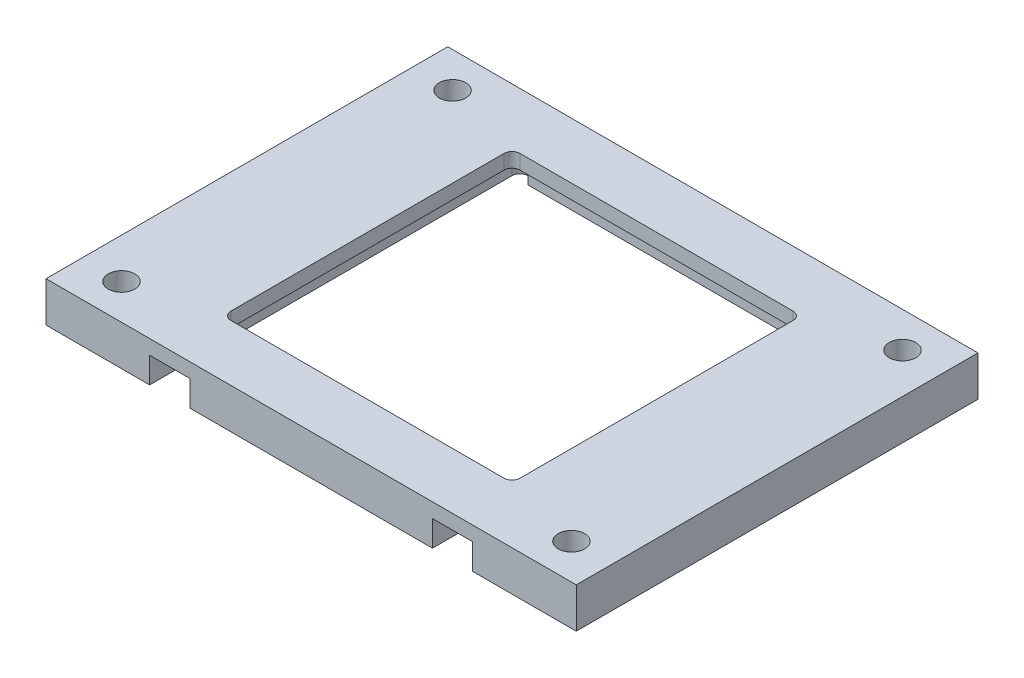
ISO-10303-21;
HEADER;
FILE_DESCRIPTION(('STEP AP214'),'2;1');
FILE_NAME('part.step','',(''),(''),'','','');
FILE_SCHEMA(('AUTOMOTIVE_DESIGN { 1 0 10303 214 1 1 1 1 }'));
ENDSEC;
DATA;
#1=APPLICATION_CONTEXT('core data for automotive mechanical design processes');
#2=APPLICATION_PROTOCOL_DEFINITION('international standard','automotive_design',2000,#1);
#3=PRODUCT_CONTEXT('',#1,'mechanical');
#4=PRODUCT('Part','Part','',(#3));
#5=PRODUCT_RELATED_PRODUCT_CATEGORY('part','',(#4));
#6=PRODUCT_DEFINITION_FORMATION('','',#4);
#7=PRODUCT_DEFINITION_CONTEXT('part definition',#1,'design');
#8=PRODUCT_DEFINITION('design','',#6,#7);
#9=PRODUCT_DEFINITION_SHAPE('','',#8);
#10=(LENGTH_UNIT() NAMED_UNIT(*) SI_UNIT(.MILLI.,.METRE.));
#11=(NAMED_UNIT(*) PLANE_ANGLE_UNIT() SI_UNIT($,.RADIAN.));
#12=(NAMED_UNIT(*) SI_UNIT($,.STERADIAN.) SOLID_ANGLE_UNIT());
#13=UNCERTAINTY_MEASURE_WITH_UNIT(LENGTH_MEASURE(1.E-05),#10,'distance_accuracy_value','');
#14=(GEOMETRIC_REPRESENTATION_CONTEXT(3) GLOBAL_UNCERTAINTY_ASSIGNED_CONTEXT((#13)) GLOBAL_UNIT_ASSIGNED_CONTEXT((#10,
#11,#12)) REPRESENTATION_CONTEXT('',''));
#15=CARTESIAN_POINT('',(0.,0.,0.));
#16=DIRECTION('',(0.,0.,1.));
#17=DIRECTION('',(1.,0.,0.));
#18=AXIS2_PLACEMENT_3D('',#15,#16,#17);
#19=CARTESIAN_POINT('',(0.,0.,0.));
#20=DIRECTION('',(0.,-1.,0.));
#21=DIRECTION('',(0.,0.,-1.));
#22=AXIS2_PLACEMENT_3D('',#19,#20,#21);
#23=PLANE('',#22);
#24=CARTESIAN_POINT('',(-19.1,0.,-20.1));
#25=DIRECTION('',(0.,-1.,0.));
#26=DIRECTION('',(0.,0.,-1.));
#27=AXIS2_PLACEMENT_3D('',#24,#25,#26);
#28=CIRCLE('',#27,1.);
#29=CARTESIAN_POINT('',(-18.1,0.,-20.1));
#30=VERTEX_POINT('',#29);
#31=CARTESIAN_POINT('',(-19.1,0.,-21.1));
#32=VERTEX_POINT('',#31);
#33=EDGE_CURVE('E58',#30,#32,#28,.F.);
#34=ORIENTED_EDGE('',*,*,#33,.T.);
#35=CARTESIAN_POINT('',(-19.1,0.,-20.1));
#36=DIRECTION('',(0.,-1.,0.));
#37=DIRECTION('',(0.,0.,-1.));
#38=AXIS2_PLACEMENT_3D('',#35,#36,#37);
#39=CIRCLE('',#38,1.);
#40=CARTESIAN_POINT('',(-20.1,0.,-20.1));
#41=VERTEX_POINT('',#40);
#42=EDGE_CURVE('E312',#32,#41,#39,.F.);
#43=ORIENTED_EDGE('',*,*,#42,.T.);
#44=DIRECTION('',(0.,0.,1.));
#45=VECTOR('',#44,1.);
#46=CARTESIAN_POINT('',(-20.1,0.,-21.1));
#47=LINE('',#46,#45);
#48=CARTESIAN_POINT('',(-20.1,0.,25.));
#49=VERTEX_POINT('',#48);
#50=EDGE_CURVE('E229',#41,#49,#47,.T.);
#51=ORIENTED_EDGE('',*,*,#50,.T.);
#52=DIRECTION('',(1.,0.,0.));
#53=VECTOR('',#52,1.);
#54=CARTESIAN_POINT('',(-33.,0.,25.));
#55=LINE('',#54,#53);
#56=CARTESIAN_POINT('',(-33.,0.,25.));
#57=VERTEX_POINT('',#56);
#58=EDGE_CURVE('E249',#57,#49,#55,.T.);
#59=ORIENTED_EDGE('',*,*,#58,.F.);
#60=DIRECTION('',(0.,0.,1.));
#61=VECTOR('',#60,1.);
#62=CARTESIAN_POINT('',(-33.,0.,25.));
#63=LINE('',#62,#61);
#64=CARTESIAN_POINT('',(-33.,0.,-25.));
#65=VERTEX_POINT('',#64);
#66=EDGE_CURVE('E260',#65,#57,#63,.T.);
#67=ORIENTED_EDGE('',*,*,#66,.F.);
#68=DIRECTION('',(-1.,0.,0.));
#69=VECTOR('',#68,1.);
#70=CARTESIAN_POINT('',(-33.,0.,-25.));
#71=LINE('',#70,#69);
#72=CARTESIAN_POINT('',(33.,0.,-25.));
#73=VERTEX_POINT('',#72);
#74=EDGE_CURVE('E258',#73,#65,#71,.T.);
#75=ORIENTED_EDGE('',*,*,#74,.F.);
#76=DIRECTION('',(0.,0.,-1.));
#77=VECTOR('',#76,1.);
#78=CARTESIAN_POINT('',(33.,0.,25.));
#79=LINE('',#78,#77);
#80=CARTESIAN_POINT('',(33.,0.,25.));
#81=VERTEX_POINT('',#80);
#82=EDGE_CURVE('E244',#81,#73,#79,.T.);
#83=ORIENTED_EDGE('',*,*,#82,.F.);
#84=CARTESIAN_POINT('',(20.1,0.,25.));
#85=VERTEX_POINT('',#84);
#86=EDGE_CURVE('E262',#85,#81,#55,.T.);
#87=ORIENTED_EDGE('',*,*,#86,.F.);
#88=DIRECTION('',(0.,0.,-1.));
#89=VECTOR('',#88,1.);
#90=CARTESIAN_POINT('',(20.1,0.,20.1));
#91=LINE('',#90,#89);
#92=CARTESIAN_POINT('',(20.1,0.,-20.1));
#93=VERTEX_POINT('',#92);
#94=EDGE_CURVE('E228',#85,#93,#91,.T.);
#95=ORIENTED_EDGE('',*,*,#94,.T.);
#96=CARTESIAN_POINT('',(19.1,0.,-20.1));
#97=DIRECTION('',(0.,-1.,0.));
#98=DIRECTION('',(0.,0.,-1.));
#99=AXIS2_PLACEMENT_3D('',#96,#97,#98);
#100=CIRCLE('',#99,1.);
#101=CARTESIAN_POINT('',(19.1,0.,-21.1));
#102=VERTEX_POINT('',#101);
#103=EDGE_CURVE('E65',#93,#102,#100,.F.);
#104=ORIENTED_EDGE('',*,*,#103,.T.);
#105=CARTESIAN_POINT('',(19.1,0.,-20.1));
#106=DIRECTION('',(0.,-1.,0.));
#107=DIRECTION('',(0.,0.,-1.));
#108=AXIS2_PLACEMENT_3D('',#105,#106,#107);
#109=CIRCLE('',#108,1.);
#110=CARTESIAN_POINT('',(18.1,0.,-20.1));
#111=VERTEX_POINT('',#110);
#112=EDGE_CURVE('E308',#102,#111,#109,.F.);
#113=ORIENTED_EDGE('',*,*,#112,.T.);
#114=DIRECTION('',(-1.,0.,0.));
#115=VECTOR('',#114,1.);
#116=CARTESIAN_POINT('',(-18.1,0.,-20.1));
#117=LINE('',#116,#115);
#118=EDGE_CURVE('E231',#111,#30,#117,.T.);
#119=ORIENTED_EDGE('',*,*,#118,.T.);
#120=EDGE_LOOP('',(#34,#43,#51,#59,#67,#75,#83,#87,#95,#104,#113,#119));
#121=FACE_BOUND('',#120,.T.);
#122=CARTESIAN_POINT('',(-28.,0.,20.6));
#123=DIRECTION('',(0.,1.,0.));
#124=DIRECTION('',(0.,0.,1.));
#125=AXIS2_PLACEMENT_3D('',#122,#123,#124);
#126=CIRCLE('',#125,1.65);
#127=CARTESIAN_POINT('',(-28.,0.,22.25));
#128=VERTEX_POINT('',#127);
#129=EDGE_CURVE('E429',#128,#128,#126,.T.);
#130=ORIENTED_EDGE('',*,*,#129,.T.);
#131=EDGE_LOOP('',(#130));
#132=FACE_BOUND('',#131,.T.);
#133=CARTESIAN_POINT('',(-28.,0.,-20.6));
#134=DIRECTION('',(0.,1.,0.));
#135=DIRECTION('',(0.,0.,1.));
#136=AXIS2_PLACEMENT_3D('',#133,#134,#135);
#137=CIRCLE('',#136,1.65);
#138=CARTESIAN_POINT('',(-28.,0.,-18.95));
#139=VERTEX_POINT('',#138);
#140=EDGE_CURVE('E441',#139,#139,#137,.T.);
#141=ORIENTED_EDGE('',*,*,#140,.T.);
#142=EDGE_LOOP('',(#141));
#143=FACE_BOUND('',#142,.T.);
#144=CARTESIAN_POINT('',(28.,0.,-20.6));
#145=DIRECTION('',(0.,1.,0.));
#146=DIRECTION('',(0.,0.,1.));
#147=AXIS2_PLACEMENT_3D('',#144,#145,#146);
#148=CIRCLE('',#147,1.65);
#149=CARTESIAN_POINT('',(28.,0.,-18.95));
#150=VERTEX_POINT('',#149);
#151=EDGE_CURVE('E435',#150,#150,#148,.T.);
#152=ORIENTED_EDGE('',*,*,#151,.T.);
#153=EDGE_LOOP('',(#152));
#154=FACE_BOUND('',#153,.T.);
#155=CARTESIAN_POINT('',(28.,0.,20.6));
#156=DIRECTION('',(0.,1.,0.));
#157=DIRECTION('',(0.,0.,1.));
#158=AXIS2_PLACEMENT_3D('',#155,#156,#157);
#159=CIRCLE('',#158,1.65);
#160=CARTESIAN_POINT('',(28.,0.,22.25));
#161=VERTEX_POINT('',#160);
#162=EDGE_CURVE('E425',#161,#161,#159,.T.);
#163=ORIENTED_EDGE('',*,*,#162,.T.);
#164=EDGE_LOOP('',(#163));
#165=FACE_BOUND('',#164,.T.);
#166=ADVANCED_FACE('F41',(#121,#132,#143,#154,#165),#23,.T.);
#167=CARTESIAN_POINT('',(-20.1,5.,-21.1));
#168=DIRECTION('',(1.,0.,0.));
#169=DIRECTION('',(0.,0.,-1.));
#170=AXIS2_PLACEMENT_3D('',#167,#168,#169);
#171=PLANE('',#170);
#172=ORIENTED_EDGE('',*,*,#50,.F.);
#173=DIRECTION('',(0.,-1.,0.));
#174=VECTOR('',#173,1.);
#175=CARTESIAN_POINT('',(-20.1,3.2,-20.1));
#176=LINE('',#175,#174);
#177=CARTESIAN_POINT('',(-20.1,3.2,-20.1));
#178=VERTEX_POINT('',#177);
#179=EDGE_CURVE('E286',#41,#178,#176,.F.);
#180=ORIENTED_EDGE('',*,*,#179,.T.);
#181=DIRECTION('',(0.,0.,1.));
#182=VECTOR('',#181,1.);
#183=CARTESIAN_POINT('',(-20.1,3.2,-21.1));
#184=LINE('',#183,#182);
#185=CARTESIAN_POINT('',(-20.1,3.2,25.));
#186=VERTEX_POINT('',#185);
#187=EDGE_CURVE('E351',#178,#186,#184,.T.);
#188=ORIENTED_EDGE('',*,*,#187,.T.);
#189=DIRECTION('',(0.,-1.,0.));
#190=VECTOR('',#189,1.);
#191=CARTESIAN_POINT('',(-20.1,0.,25.));
#192=LINE('',#191,#190);
#193=EDGE_CURVE('E223',#186,#49,#192,.T.);
#194=ORIENTED_EDGE('',*,*,#193,.T.);
#195=EDGE_LOOP('',(#172,#180,#188,#194));
#196=FACE_BOUND('',#195,.T.);
#197=ADVANCED_FACE('F348',(#196),#171,.T.);
#198=CARTESIAN_POINT('',(-20.1,5.,20.1));
#199=DIRECTION('',(0.,0.,-1.));
#200=DIRECTION('',(-1.,0.,0.));
#201=AXIS2_PLACEMENT_3D('',#198,#199,#200);
#202=PLANE('',#201);
#203=DIRECTION('',(0.,1.,0.));
#204=VECTOR('',#203,1.);
#205=CARTESIAN_POINT('',(-15.1,0.,20.1));
#206=LINE('',#205,#204);
#207=CARTESIAN_POINT('',(-15.1,0.,20.1));
#208=VERTEX_POINT('',#207);
#209=CARTESIAN_POINT('',(-15.1,3.2,20.1));
#210=VERTEX_POINT('',#209);
#211=EDGE_CURVE('E202',#208,#210,#206,.T.);
#212=ORIENTED_EDGE('',*,*,#211,.T.);
#213=DIRECTION('',(1.,0.,0.));
#214=VECTOR('',#213,1.);
#215=CARTESIAN_POINT('',(-20.1,3.2,20.1));
#216=LINE('',#215,#214);
#217=CARTESIAN_POINT('',(15.1,3.2,20.1));
#218=VERTEX_POINT('',#217);
#219=EDGE_CURVE('E417',#210,#218,#216,.T.);
#220=ORIENTED_EDGE('',*,*,#219,.T.);
#221=DIRECTION('',(0.,-1.,0.));
#222=VECTOR('',#221,1.);
#223=CARTESIAN_POINT('',(15.1,0.,20.1));
#224=LINE('',#223,#222);
#225=CARTESIAN_POINT('',(15.1,0.,20.1));
#226=VERTEX_POINT('',#225);
#227=EDGE_CURVE('E213',#218,#226,#224,.T.);
#228=ORIENTED_EDGE('',*,*,#227,.T.);
#229=DIRECTION('',(1.,0.,0.));
#230=VECTOR('',#229,1.);
#231=CARTESIAN_POINT('',(-20.1,0.,20.1));
#232=LINE('',#231,#230);
#233=EDGE_CURVE('E220',#208,#226,#232,.T.);
#234=ORIENTED_EDGE('',*,*,#233,.F.);
#235=EDGE_LOOP('',(#212,#220,#228,#234));
#236=FACE_BOUND('',#235,.T.);
#237=ADVANCED_FACE('F226',(#236),#202,.T.);
#238=CARTESIAN_POINT('',(20.1,5.,20.1));
#239=DIRECTION('',(-1.,0.,0.));
#240=DIRECTION('',(0.,0.,1.));
#241=AXIS2_PLACEMENT_3D('',#238,#239,#240);
#242=PLANE('',#241);
#243=DIRECTION('',(0.,0.,-1.));
#244=VECTOR('',#243,1.);
#245=CARTESIAN_POINT('',(20.1,3.2,20.1));
#246=LINE('',#245,#244);
#247=CARTESIAN_POINT('',(20.1,3.2,25.));
#248=VERTEX_POINT('',#247);
#249=CARTESIAN_POINT('',(20.1,3.2,-20.1));
#250=VERTEX_POINT('',#249);
#251=EDGE_CURVE('E419',#248,#250,#246,.T.);
#252=ORIENTED_EDGE('',*,*,#251,.T.);
#253=DIRECTION('',(0.,-1.,0.));
#254=VECTOR('',#253,1.);
#255=CARTESIAN_POINT('',(20.1,0.,-20.1));
#256=LINE('',#255,#254);
#257=EDGE_CURVE('E284',#250,#93,#256,.T.);
#258=ORIENTED_EDGE('',*,*,#257,.T.);
#259=ORIENTED_EDGE('',*,*,#94,.F.);
#260=DIRECTION('',(0.,1.,0.));
#261=VECTOR('',#260,1.);
#262=CARTESIAN_POINT('',(20.1,0.,25.));
#263=LINE('',#262,#261);
#264=EDGE_CURVE('E386',#85,#248,#263,.T.);
#265=ORIENTED_EDGE('',*,*,#264,.T.);
#266=EDGE_LOOP('',(#252,#258,#259,#265));
#267=FACE_BOUND('',#266,.T.);
#268=ADVANCED_FACE('F487',(#267),#242,.T.);
#269=CARTESIAN_POINT('',(-18.1,5.,-20.1));
#270=DIRECTION('',(0.,0.,1.));
#271=DIRECTION('',(1.,0.,0.));
#272=AXIS2_PLACEMENT_3D('',#269,#270,#271);
#273=PLANE('',#272);
#274=DIRECTION('',(0.,-1.,0.));
#275=VECTOR('',#274,1.);
#276=CARTESIAN_POINT('',(18.1,5.,-20.1));
#277=LINE('',#276,#275);
#278=CARTESIAN_POINT('',(18.1,3.2,-20.1));
#279=VERTEX_POINT('',#278);
#280=EDGE_CURVE('E241',#279,#111,#277,.T.);
#281=ORIENTED_EDGE('',*,*,#280,.F.);
#282=DIRECTION('',(-1.,0.,0.));
#283=VECTOR('',#282,1.);
#284=CARTESIAN_POINT('',(18.1,3.2,-20.1));
#285=LINE('',#284,#283);
#286=CARTESIAN_POINT('',(-18.1,3.2,-20.1));
#287=VERTEX_POINT('',#286);
#288=EDGE_CURVE('E422',#279,#287,#285,.T.);
#289=ORIENTED_EDGE('',*,*,#288,.T.);
#290=DIRECTION('',(0.,-1.,0.));
#291=VECTOR('',#290,1.);
#292=CARTESIAN_POINT('',(-18.1,5.,-20.1));
#293=LINE('',#292,#291);
#294=EDGE_CURVE('E238',#287,#30,#293,.T.);
#295=ORIENTED_EDGE('',*,*,#294,.T.);
#296=ORIENTED_EDGE('',*,*,#118,.F.);
#297=EDGE_LOOP('',(#281,#289,#295,#296));
#298=FACE_BOUND('',#297,.T.);
#299=ADVANCED_FACE('F481',(#298),#273,.T.);
#300=CARTESIAN_POINT('',(0.,5.,0.));
#301=DIRECTION('',(0.,-1.,0.));
#302=DIRECTION('',(0.,0.,-1.));
#303=AXIS2_PLACEMENT_3D('',#300,#301,#302);
#304=PLANE('',#303);
#305=DIRECTION('',(0.,0.,-1.));
#306=VECTOR('',#305,1.);
#307=CARTESIAN_POINT('',(33.,5.,25.));
#308=LINE('',#307,#306);
#309=CARTESIAN_POINT('',(33.,5.,25.));
#310=VERTEX_POINT('',#309);
#311=CARTESIAN_POINT('',(33.,5.,-25.));
#312=VERTEX_POINT('',#311);
#313=EDGE_CURVE('E245',#310,#312,#308,.T.);
#314=ORIENTED_EDGE('',*,*,#313,.T.);
#315=DIRECTION('',(-1.,0.,0.));
#316=VECTOR('',#315,1.);
#317=CARTESIAN_POINT('',(-33.,5.,-25.));
#318=LINE('',#317,#316);
#319=CARTESIAN_POINT('',(-33.,5.,-25.));
#320=VERTEX_POINT('',#319);
#321=EDGE_CURVE('E248',#312,#320,#318,.T.);
#322=ORIENTED_EDGE('',*,*,#321,.T.);
#323=DIRECTION('',(0.,0.,1.));
#324=VECTOR('',#323,1.);
#325=CARTESIAN_POINT('',(-33.,5.,25.));
#326=LINE('',#325,#324);
#327=CARTESIAN_POINT('',(-33.,5.,25.));
#328=VERTEX_POINT('',#327);
#329=EDGE_CURVE('E251',#320,#328,#326,.T.);
#330=ORIENTED_EDGE('',*,*,#329,.T.);
#331=DIRECTION('',(1.,0.,0.));
#332=VECTOR('',#331,1.);
#333=CARTESIAN_POINT('',(-33.,5.,25.));
#334=LINE('',#333,#332);
#335=EDGE_CURVE('E253',#328,#310,#334,.T.);
#336=ORIENTED_EDGE('',*,*,#335,.T.);
#337=EDGE_LOOP('',(#314,#322,#330,#336));
#338=FACE_BOUND('',#337,.T.);
#339=CARTESIAN_POINT('',(-28.,5.,-20.6));
#340=DIRECTION('',(0.,1.,0.));
#341=DIRECTION('',(0.,0.,1.));
#342=AXIS2_PLACEMENT_3D('',#339,#340,#341);
#343=CIRCLE('',#342,1.65);
#344=CARTESIAN_POINT('',(-28.,5.,-18.95));
#345=VERTEX_POINT('',#344);
#346=EDGE_CURVE('E233',#345,#345,#343,.T.);
#347=ORIENTED_EDGE('',*,*,#346,.F.);
#348=EDGE_LOOP('',(#347));
#349=FACE_BOUND('',#348,.T.);
#350=CARTESIAN_POINT('',(28.,5.,-20.6));
#351=DIRECTION('',(0.,1.,0.));
#352=DIRECTION('',(0.,0.,1.));
#353=AXIS2_PLACEMENT_3D('',#350,#351,#352);
#354=CIRCLE('',#353,1.65);
#355=CARTESIAN_POINT('',(28.,5.,-18.95));
#356=VERTEX_POINT('',#355);
#357=EDGE_CURVE('E438',#356,#356,#354,.T.);
#358=ORIENTED_EDGE('',*,*,#357,.F.);
#359=EDGE_LOOP('',(#358));
#360=FACE_BOUND('',#359,.T.);
#361=CARTESIAN_POINT('',(-28.,5.,20.6));
#362=DIRECTION('',(0.,1.,0.));
#363=DIRECTION('',(0.,0.,1.));
#364=AXIS2_PLACEMENT_3D('',#361,#362,#363);
#365=CIRCLE('',#364,1.65);
#366=CARTESIAN_POINT('',(-28.,5.,22.25));
#367=VERTEX_POINT('',#366);
#368=EDGE_CURVE('E432',#367,#367,#365,.T.);
#369=ORIENTED_EDGE('',*,*,#368,.F.);
#370=EDGE_LOOP('',(#369));
#371=FACE_BOUND('',#370,.T.);
#372=CARTESIAN_POINT('',(28.,5.,20.6));
#373=DIRECTION('',(0.,1.,0.));
#374=DIRECTION('',(0.,0.,1.));
#375=AXIS2_PLACEMENT_3D('',#372,#373,#374);
#376=CIRCLE('',#375,1.65);
#377=CARTESIAN_POINT('',(28.,5.,22.25));
#378=VERTEX_POINT('',#377);
#379=EDGE_CURVE('E426',#378,#378,#376,.T.);
#380=ORIENTED_EDGE('',*,*,#379,.F.);
#381=EDGE_LOOP('',(#380));
#382=FACE_BOUND('',#381,.T.);
#383=DIRECTION('',(0.,0.,1.));
#384=VECTOR('',#383,1.);
#385=CARTESIAN_POINT('',(-18.,5.,-18.));
#386=LINE('',#385,#384);
#387=CARTESIAN_POINT('',(-18.,5.,-17.));
#388=VERTEX_POINT('',#387);
#389=CARTESIAN_POINT('',(-18.,5.,17.));
#390=VERTEX_POINT('',#389);
#391=EDGE_CURVE('E379',#388,#390,#386,.T.);
#392=ORIENTED_EDGE('',*,*,#391,.F.);
#393=CARTESIAN_POINT('',(-17.,5.,-17.));
#394=DIRECTION('',(0.,-1.,0.));
#395=DIRECTION('',(0.,0.,-1.));
#396=AXIS2_PLACEMENT_3D('',#393,#394,#395);
#397=CIRCLE('',#396,1.);
#398=CARTESIAN_POINT('',(-17.,5.,-18.));
#399=VERTEX_POINT('',#398);
#400=EDGE_CURVE('E50',#388,#399,#397,.T.);
#401=ORIENTED_EDGE('',*,*,#400,.T.);
#402=DIRECTION('',(-1.,0.,0.));
#403=VECTOR('',#402,1.);
#404=CARTESIAN_POINT('',(18.,5.,-18.));
#405=LINE('',#404,#403);
#406=CARTESIAN_POINT('',(17.,5.,-18.));
#407=VERTEX_POINT('',#406);
#408=EDGE_CURVE('E397',#407,#399,#405,.T.);
#409=ORIENTED_EDGE('',*,*,#408,.F.);
#410=CARTESIAN_POINT('',(17.,5.,-17.));
#411=DIRECTION('',(0.,-1.,0.));
#412=DIRECTION('',(0.,0.,-1.));
#413=AXIS2_PLACEMENT_3D('',#410,#411,#412);
#414=CIRCLE('',#413,1.);
#415=CARTESIAN_POINT('',(18.,5.,-17.));
#416=VERTEX_POINT('',#415);
#417=EDGE_CURVE('E322',#407,#416,#414,.T.);
#418=ORIENTED_EDGE('',*,*,#417,.T.);
#419=DIRECTION('',(0.,0.,-1.));
#420=VECTOR('',#419,1.);
#421=CARTESIAN_POINT('',(18.,5.,18.));
#422=LINE('',#421,#420);
#423=CARTESIAN_POINT('',(18.,5.,17.));
#424=VERTEX_POINT('',#423);
#425=EDGE_CURVE('E411',#424,#416,#422,.T.);
#426=ORIENTED_EDGE('',*,*,#425,.F.);
#427=CARTESIAN_POINT('',(17.,5.,17.));
#428=DIRECTION('',(0.,-1.,0.));
#429=DIRECTION('',(0.,0.,-1.));
#430=AXIS2_PLACEMENT_3D('',#427,#428,#429);
#431=CIRCLE('',#430,1.);
#432=CARTESIAN_POINT('',(17.,5.,18.));
#433=VERTEX_POINT('',#432);
#434=EDGE_CURVE('E318',#424,#433,#431,.T.);
#435=ORIENTED_EDGE('',*,*,#434,.T.);
#436=DIRECTION('',(1.,0.,0.));
#437=VECTOR('',#436,1.);
#438=CARTESIAN_POINT('',(-18.,5.,18.));
#439=LINE('',#438,#437);
#440=CARTESIAN_POINT('',(-17.,5.,18.));
#441=VERTEX_POINT('',#440);
#442=EDGE_CURVE('E408',#441,#433,#439,.T.);
#443=ORIENTED_EDGE('',*,*,#442,.F.);
#444=CARTESIAN_POINT('',(-17.,5.,17.));
#445=DIRECTION('',(0.,-1.,0.));
#446=DIRECTION('',(0.,0.,-1.));
#447=AXIS2_PLACEMENT_3D('',#444,#445,#446);
#448=CIRCLE('',#447,1.);
#449=EDGE_CURVE('E314',#441,#390,#448,.T.);
#450=ORIENTED_EDGE('',*,*,#449,.T.);
#451=EDGE_LOOP('',(#392,#401,#409,#418,#426,#435,#443,#450));
#452=FACE_BOUND('',#451,.T.);
#453=ADVANCED_FACE('F474',(#338,#349,#360,#371,#382,#452),#304,.F.);
#454=DIRECTION('',(0.,0.,1.));
#455=VECTOR('',#454,1.);
#456=CARTESIAN_POINT('',(-15.1,0.,-25.001));
#457=LINE('',#456,#455);
#458=CARTESIAN_POINT('',(-15.1,0.,25.));
#459=VERTEX_POINT('',#458);
#460=EDGE_CURVE('E206',#208,#459,#457,.T.);
#461=ORIENTED_EDGE('',*,*,#460,.F.);
#462=ORIENTED_EDGE('',*,*,#233,.T.);
#463=DIRECTION('',(0.,0.,1.));
#464=VECTOR('',#463,1.);
#465=CARTESIAN_POINT('',(15.1,0.,-25.001));
#466=LINE('',#465,#464);
#467=CARTESIAN_POINT('',(15.1,0.,25.));
#468=VERTEX_POINT('',#467);
#469=EDGE_CURVE('E385',#226,#468,#466,.T.);
#470=ORIENTED_EDGE('',*,*,#469,.T.);
#471=EDGE_CURVE('E222',#459,#468,#55,.T.);
#472=ORIENTED_EDGE('',*,*,#471,.F.);
#473=EDGE_LOOP('',(#461,#462,#470,#472));
#474=FACE_BOUND('',#473,.T.);
#475=ADVANCED_FACE('F218',(#474),#23,.T.);
#476=CARTESIAN_POINT('',(33.,5.,25.));
#477=DIRECTION('',(-1.,0.,0.));
#478=DIRECTION('',(0.,0.,1.));
#479=AXIS2_PLACEMENT_3D('',#476,#477,#478);
#480=PLANE('',#479);
#481=ORIENTED_EDGE('',*,*,#82,.T.);
#482=DIRECTION('',(0.,-1.,0.));
#483=VECTOR('',#482,1.);
#484=CARTESIAN_POINT('',(33.,5.,-25.));
#485=LINE('',#484,#483);
#486=EDGE_CURVE('E273',#312,#73,#485,.T.);
#487=ORIENTED_EDGE('',*,*,#486,.F.);
#488=ORIENTED_EDGE('',*,*,#313,.F.);
#489=DIRECTION('',(0.,-1.,0.));
#490=VECTOR('',#489,1.);
#491=CARTESIAN_POINT('',(33.,5.,25.));
#492=LINE('',#491,#490);
#493=EDGE_CURVE('E255',#310,#81,#492,.T.);
#494=ORIENTED_EDGE('',*,*,#493,.T.);
#495=EDGE_LOOP('',(#481,#487,#488,#494));
#496=FACE_BOUND('',#495,.T.);
#497=ADVANCED_FACE('F371',(#496),#480,.F.);
#498=CARTESIAN_POINT('',(-33.,5.,-25.));
#499=DIRECTION('',(0.,0.,1.));
#500=DIRECTION('',(1.,0.,0.));
#501=AXIS2_PLACEMENT_3D('',#498,#499,#500);
#502=PLANE('',#501);
#503=ORIENTED_EDGE('',*,*,#74,.T.);
#504=DIRECTION('',(0.,-1.,0.));
#505=VECTOR('',#504,1.);
#506=CARTESIAN_POINT('',(-33.,5.,-25.));
#507=LINE('',#506,#505);
#508=EDGE_CURVE('E270',#320,#65,#507,.T.);
#509=ORIENTED_EDGE('',*,*,#508,.F.);
#510=ORIENTED_EDGE('',*,*,#321,.F.);
#511=ORIENTED_EDGE('',*,*,#486,.T.);
#512=EDGE_LOOP('',(#503,#509,#510,#511));
#513=FACE_BOUND('',#512,.T.);
#514=ADVANCED_FACE('F367',(#513),#502,.F.);
#515=CARTESIAN_POINT('',(-33.,5.,25.));
#516=DIRECTION('',(1.,0.,0.));
#517=DIRECTION('',(0.,0.,-1.));
#518=AXIS2_PLACEMENT_3D('',#515,#516,#517);
#519=PLANE('',#518);
#520=ORIENTED_EDGE('',*,*,#66,.T.);
#521=DIRECTION('',(0.,-1.,0.));
#522=VECTOR('',#521,1.);
#523=CARTESIAN_POINT('',(-33.,5.,25.));
#524=LINE('',#523,#522);
#525=EDGE_CURVE('E267',#328,#57,#524,.T.);
#526=ORIENTED_EDGE('',*,*,#525,.F.);
#527=ORIENTED_EDGE('',*,*,#329,.F.);
#528=ORIENTED_EDGE('',*,*,#508,.T.);
#529=EDGE_LOOP('',(#520,#526,#527,#528));
#530=FACE_BOUND('',#529,.T.);
#531=ADVANCED_FACE('F363',(#530),#519,.F.);
#532=CARTESIAN_POINT('',(-33.,5.,25.));
#533=DIRECTION('',(0.,0.,-1.));
#534=DIRECTION('',(-1.,0.,0.));
#535=AXIS2_PLACEMENT_3D('',#532,#533,#534);
#536=PLANE('',#535);
#537=ORIENTED_EDGE('',*,*,#58,.T.);
#538=ORIENTED_EDGE('',*,*,#193,.F.);
#539=DIRECTION('',(-1.,0.,0.));
#540=VECTOR('',#539,1.);
#541=CARTESIAN_POINT('',(-20.1,3.2,25.));
#542=LINE('',#541,#540);
#543=CARTESIAN_POINT('',(-15.1,3.2,25.));
#544=VERTEX_POINT('',#543);
#545=EDGE_CURVE('E377',#544,#186,#542,.T.);
#546=ORIENTED_EDGE('',*,*,#545,.F.);
#547=DIRECTION('',(0.,1.,0.));
#548=VECTOR('',#547,1.);
#549=CARTESIAN_POINT('',(-15.1,0.,25.));
#550=LINE('',#549,#548);
#551=EDGE_CURVE('E355',#459,#544,#550,.T.);
#552=ORIENTED_EDGE('',*,*,#551,.F.);
#553=ORIENTED_EDGE('',*,*,#471,.T.);
#554=DIRECTION('',(0.,-1.,0.));
#555=VECTOR('',#554,1.);
#556=CARTESIAN_POINT('',(15.1,0.,25.));
#557=LINE('',#556,#555);
#558=CARTESIAN_POINT('',(15.1,3.2,25.));
#559=VERTEX_POINT('',#558);
#560=EDGE_CURVE('E328',#559,#468,#557,.T.);
#561=ORIENTED_EDGE('',*,*,#560,.F.);
#562=DIRECTION('',(-1.,0.,0.));
#563=VECTOR('',#562,1.);
#564=CARTESIAN_POINT('',(20.1,3.2,25.));
#565=LINE('',#564,#563);
#566=EDGE_CURVE('E331',#248,#559,#565,.T.);
#567=ORIENTED_EDGE('',*,*,#566,.F.);
#568=ORIENTED_EDGE('',*,*,#264,.F.);
#569=ORIENTED_EDGE('',*,*,#86,.T.);
#570=ORIENTED_EDGE('',*,*,#493,.F.);
#571=ORIENTED_EDGE('',*,*,#335,.F.);
#572=ORIENTED_EDGE('',*,*,#525,.T.);
#573=EDGE_LOOP('',(#537,#538,#546,#552,#553,#561,#567,#568,#569,#570,#571,#572));
#574=FACE_BOUND('',#573,.T.);
#575=ADVANCED_FACE('F357',(#574),#536,.F.);
#576=CARTESIAN_POINT('',(-28.,5.,-20.6));
#577=DIRECTION('',(0.,-1.,0.));
#578=DIRECTION('',(0.,0.,-1.));
#579=AXIS2_PLACEMENT_3D('',#576,#577,#578);
#580=CYLINDRICAL_SURFACE('',#579,1.65);
#581=ORIENTED_EDGE('',*,*,#346,.T.);
#582=EDGE_LOOP('',(#581));
#583=FACE_BOUND('',#582,.T.);
#584=ORIENTED_EDGE('',*,*,#140,.F.);
#585=EDGE_LOOP('',(#584));
#586=FACE_BOUND('',#585,.T.);
#587=ADVANCED_FACE('F450',(#583,#586),#580,.F.);
#588=CARTESIAN_POINT('',(28.,5.,-20.6));
#589=DIRECTION('',(0.,-1.,0.));
#590=DIRECTION('',(0.,0.,-1.));
#591=AXIS2_PLACEMENT_3D('',#588,#589,#590);
#592=CYLINDRICAL_SURFACE('',#591,1.65);
#593=ORIENTED_EDGE('',*,*,#357,.T.);
#594=EDGE_LOOP('',(#593));
#595=FACE_BOUND('',#594,.T.);
#596=ORIENTED_EDGE('',*,*,#151,.F.);
#597=EDGE_LOOP('',(#596));
#598=FACE_BOUND('',#597,.T.);
#599=ADVANCED_FACE('F452',(#595,#598),#592,.F.);
#600=CARTESIAN_POINT('',(-28.,5.,20.6));
#601=DIRECTION('',(0.,-1.,0.));
#602=DIRECTION('',(0.,0.,-1.));
#603=AXIS2_PLACEMENT_3D('',#600,#601,#602);
#604=CYLINDRICAL_SURFACE('',#603,1.65);
#605=ORIENTED_EDGE('',*,*,#368,.T.);
#606=EDGE_LOOP('',(#605));
#607=FACE_BOUND('',#606,.T.);
#608=ORIENTED_EDGE('',*,*,#129,.F.);
#609=EDGE_LOOP('',(#608));
#610=FACE_BOUND('',#609,.T.);
#611=ADVANCED_FACE('F459',(#607,#610),#604,.F.);
#612=CARTESIAN_POINT('',(28.,5.,20.6));
#613=DIRECTION('',(0.,-1.,0.));
#614=DIRECTION('',(0.,0.,-1.));
#615=AXIS2_PLACEMENT_3D('',#612,#613,#614);
#616=CYLINDRICAL_SURFACE('',#615,1.65);
#617=ORIENTED_EDGE('',*,*,#379,.T.);
#618=EDGE_LOOP('',(#617));
#619=FACE_BOUND('',#618,.T.);
#620=ORIENTED_EDGE('',*,*,#162,.F.);
#621=EDGE_LOOP('',(#620));
#622=FACE_BOUND('',#621,.T.);
#623=ADVANCED_FACE('F531',(#619,#622),#616,.F.);
#624=CARTESIAN_POINT('',(0.,3.2,0.));
#625=DIRECTION('',(0.,1.,0.));
#626=DIRECTION('',(0.,0.,1.));
#627=AXIS2_PLACEMENT_3D('',#624,#625,#626);
#628=PLANE('',#627);
#629=DIRECTION('',(0.,0.,-1.));
#630=VECTOR('',#629,1.);
#631=CARTESIAN_POINT('',(18.,3.2,18.));
#632=LINE('',#631,#630);
#633=CARTESIAN_POINT('',(18.,3.2,17.));
#634=VERTEX_POINT('',#633);
#635=CARTESIAN_POINT('',(18.,3.2,-17.));
#636=VERTEX_POINT('',#635);
#637=EDGE_CURVE('E400',#634,#636,#632,.T.);
#638=ORIENTED_EDGE('',*,*,#637,.T.);
#639=CARTESIAN_POINT('',(17.,3.2,-17.));
#640=DIRECTION('',(0.,1.,0.));
#641=DIRECTION('',(0.,0.,1.));
#642=AXIS2_PLACEMENT_3D('',#639,#640,#641);
#643=CIRCLE('',#642,1.);
#644=CARTESIAN_POINT('',(17.,3.2,-18.));
#645=VERTEX_POINT('',#644);
#646=EDGE_CURVE('E324',#636,#645,#643,.T.);
#647=ORIENTED_EDGE('',*,*,#646,.T.);
#648=DIRECTION('',(-1.,0.,0.));
#649=VECTOR('',#648,1.);
#650=CARTESIAN_POINT('',(18.,3.2,-18.));
#651=LINE('',#650,#649);
#652=CARTESIAN_POINT('',(-17.,3.2,-18.));
#653=VERTEX_POINT('',#652);
#654=EDGE_CURVE('E403',#645,#653,#651,.T.);
#655=ORIENTED_EDGE('',*,*,#654,.T.);
#656=CARTESIAN_POINT('',(-17.,3.2,-17.));
#657=DIRECTION('',(0.,1.,0.));
#658=DIRECTION('',(0.,0.,1.));
#659=AXIS2_PLACEMENT_3D('',#656,#657,#658);
#660=CIRCLE('',#659,1.);
#661=CARTESIAN_POINT('',(-18.,3.2,-17.));
#662=VERTEX_POINT('',#661);
#663=EDGE_CURVE('E11',#653,#662,#660,.T.);
#664=ORIENTED_EDGE('',*,*,#663,.T.);
#665=DIRECTION('',(0.,0.,1.));
#666=VECTOR('',#665,1.);
#667=CARTESIAN_POINT('',(-18.,3.2,-18.));
#668=LINE('',#667,#666);
#669=CARTESIAN_POINT('',(-18.,3.2,17.));
#670=VERTEX_POINT('',#669);
#671=EDGE_CURVE('E393',#662,#670,#668,.T.);
#672=ORIENTED_EDGE('',*,*,#671,.T.);
#673=CARTESIAN_POINT('',(-17.,3.2,17.));
#674=DIRECTION('',(0.,1.,0.));
#675=DIRECTION('',(0.,0.,1.));
#676=AXIS2_PLACEMENT_3D('',#673,#674,#675);
#677=CIRCLE('',#676,1.);
#678=CARTESIAN_POINT('',(-17.,3.2,18.));
#679=VERTEX_POINT('',#678);
#680=EDGE_CURVE('E316',#670,#679,#677,.T.);
#681=ORIENTED_EDGE('',*,*,#680,.T.);
#682=DIRECTION('',(1.,0.,0.));
#683=VECTOR('',#682,1.);
#684=CARTESIAN_POINT('',(-18.,3.2,18.));
#685=LINE('',#684,#683);
#686=CARTESIAN_POINT('',(17.,3.2,18.));
#687=VERTEX_POINT('',#686);
#688=EDGE_CURVE('E396',#679,#687,#685,.T.);
#689=ORIENTED_EDGE('',*,*,#688,.T.);
#690=CARTESIAN_POINT('',(17.,3.2,17.));
#691=DIRECTION('',(0.,1.,0.));
#692=DIRECTION('',(0.,0.,1.));
#693=AXIS2_PLACEMENT_3D('',#690,#691,#692);
#694=CIRCLE('',#693,1.);
#695=EDGE_CURVE('E320',#687,#634,#694,.T.);
#696=ORIENTED_EDGE('',*,*,#695,.T.);
#697=EDGE_LOOP('',(#638,#647,#655,#664,#672,#681,#689,#696));
#698=FACE_BOUND('',#697,.T.);
#699=ORIENTED_EDGE('',*,*,#288,.F.);
#700=CARTESIAN_POINT('',(19.1,3.2,-20.1));
#701=DIRECTION('',(0.,1.,0.));
#702=DIRECTION('',(0.,0.,1.));
#703=AXIS2_PLACEMENT_3D('',#700,#701,#702);
#704=CIRCLE('',#703,1.);
#705=CARTESIAN_POINT('',(19.1,3.2,-21.1));
#706=VERTEX_POINT('',#705);
#707=EDGE_CURVE('E282',#279,#706,#704,.F.);
#708=ORIENTED_EDGE('',*,*,#707,.T.);
#709=CARTESIAN_POINT('',(19.1,3.2,-20.1));
#710=DIRECTION('',(0.,1.,0.));
#711=DIRECTION('',(0.,0.,1.));
#712=AXIS2_PLACEMENT_3D('',#709,#710,#711);
#713=CIRCLE('',#712,1.);
#714=EDGE_CURVE('E280',#706,#250,#713,.F.);
#715=ORIENTED_EDGE('',*,*,#714,.T.);
#716=ORIENTED_EDGE('',*,*,#251,.F.);
#717=ORIENTED_EDGE('',*,*,#566,.T.);
#718=DIRECTION('',(0.,0.,1.));
#719=VECTOR('',#718,1.);
#720=CARTESIAN_POINT('',(15.1,3.2,-25.001));
#721=LINE('',#720,#719);
#722=EDGE_CURVE('E383',#218,#559,#721,.T.);
#723=ORIENTED_EDGE('',*,*,#722,.F.);
#724=ORIENTED_EDGE('',*,*,#219,.F.);
#725=DIRECTION('',(0.,0.,1.));
#726=VECTOR('',#725,1.);
#727=CARTESIAN_POINT('',(-15.1,3.2,-25.001));
#728=LINE('',#727,#726);
#729=EDGE_CURVE('E208',#210,#544,#728,.T.);
#730=ORIENTED_EDGE('',*,*,#729,.T.);
#731=ORIENTED_EDGE('',*,*,#545,.T.);
#732=ORIENTED_EDGE('',*,*,#187,.F.);
#733=CARTESIAN_POINT('',(-19.1,3.2,-20.1));
#734=DIRECTION('',(0.,1.,0.));
#735=DIRECTION('',(0.,0.,1.));
#736=AXIS2_PLACEMENT_3D('',#733,#734,#735);
#737=CIRCLE('',#736,1.);
#738=CARTESIAN_POINT('',(-19.1,3.2,-21.1));
#739=VERTEX_POINT('',#738);
#740=EDGE_CURVE('E276',#178,#739,#737,.F.);
#741=ORIENTED_EDGE('',*,*,#740,.T.);
#742=CARTESIAN_POINT('',(-19.1,3.2,-20.1));
#743=DIRECTION('',(0.,1.,0.));
#744=DIRECTION('',(0.,0.,1.));
#745=AXIS2_PLACEMENT_3D('',#742,#743,#744);
#746=CIRCLE('',#745,1.);
#747=EDGE_CURVE('E278',#739,#287,#746,.F.);
#748=ORIENTED_EDGE('',*,*,#747,.T.);
#749=EDGE_LOOP('',(#699,#708,#715,#716,#717,#723,#724,#730,#731,#732,#741,#748));
#750=FACE_BOUND('',#749,.T.);
#751=ADVANCED_FACE('F505',(#698,#750),#628,.F.);
#752=CARTESIAN_POINT('',(-18.,3.2,-18.));
#753=DIRECTION('',(-1.,0.,0.));
#754=DIRECTION('',(0.,0.,1.));
#755=AXIS2_PLACEMENT_3D('',#752,#753,#754);
#756=PLANE('',#755);
#757=ORIENTED_EDGE('',*,*,#391,.T.);
#758=DIRECTION('',(0.,1.,0.));
#759=VECTOR('',#758,1.);
#760=CARTESIAN_POINT('',(-18.,3.2,17.));
#761=LINE('',#760,#759);
#762=EDGE_CURVE('E296',#390,#670,#761,.F.);
#763=ORIENTED_EDGE('',*,*,#762,.T.);
#764=ORIENTED_EDGE('',*,*,#671,.F.);
#765=DIRECTION('',(0.,1.,0.));
#766=VECTOR('',#765,1.);
#767=CARTESIAN_POINT('',(-18.,5.,-17.));
#768=LINE('',#767,#766);
#769=EDGE_CURVE('E293',#662,#388,#768,.T.);
#770=ORIENTED_EDGE('',*,*,#769,.T.);
#771=EDGE_LOOP('',(#757,#763,#764,#770));
#772=FACE_BOUND('',#771,.T.);
#773=ADVANCED_FACE('F522',(#772),#756,.F.);
#774=CARTESIAN_POINT('',(18.,3.2,-18.));
#775=DIRECTION('',(0.,0.,-1.));
#776=DIRECTION('',(-1.,0.,0.));
#777=AXIS2_PLACEMENT_3D('',#774,#775,#776);
#778=PLANE('',#777);
#779=ORIENTED_EDGE('',*,*,#654,.F.);
#780=DIRECTION('',(0.,1.,0.));
#781=VECTOR('',#780,1.);
#782=CARTESIAN_POINT('',(17.,5.,-18.));
#783=LINE('',#782,#781);
#784=EDGE_CURVE('E305',#645,#407,#783,.T.);
#785=ORIENTED_EDGE('',*,*,#784,.T.);
#786=ORIENTED_EDGE('',*,*,#408,.T.);
#787=DIRECTION('',(0.,1.,0.));
#788=VECTOR('',#787,1.);
#789=CARTESIAN_POINT('',(-17.,3.2,-18.));
#790=LINE('',#789,#788);
#791=EDGE_CURVE('E303',#399,#653,#790,.F.);
#792=ORIENTED_EDGE('',*,*,#791,.T.);
#793=EDGE_LOOP('',(#779,#785,#786,#792));
#794=FACE_BOUND('',#793,.T.);
#795=ADVANCED_FACE('F519',(#794),#778,.F.);
#796=CARTESIAN_POINT('',(18.,3.2,18.));
#797=DIRECTION('',(1.,0.,0.));
#798=DIRECTION('',(0.,0.,-1.));
#799=AXIS2_PLACEMENT_3D('',#796,#797,#798);
#800=PLANE('',#799);
#801=ORIENTED_EDGE('',*,*,#637,.F.);
#802=DIRECTION('',(0.,1.,0.));
#803=VECTOR('',#802,1.);
#804=CARTESIAN_POINT('',(18.,5.,17.));
#805=LINE('',#804,#803);
#806=EDGE_CURVE('E300',#634,#424,#805,.T.);
#807=ORIENTED_EDGE('',*,*,#806,.T.);
#808=ORIENTED_EDGE('',*,*,#425,.T.);
#809=DIRECTION('',(0.,1.,0.));
#810=VECTOR('',#809,1.);
#811=CARTESIAN_POINT('',(18.,3.2,-17.));
#812=LINE('',#811,#810);
#813=EDGE_CURVE('E298',#416,#636,#812,.F.);
#814=ORIENTED_EDGE('',*,*,#813,.T.);
#815=EDGE_LOOP('',(#801,#807,#808,#814));
#816=FACE_BOUND('',#815,.T.);
#817=ADVANCED_FACE('F515',(#816),#800,.F.);
#818=CARTESIAN_POINT('',(-18.,3.2,18.));
#819=DIRECTION('',(0.,0.,1.));
#820=DIRECTION('',(1.,0.,0.));
#821=AXIS2_PLACEMENT_3D('',#818,#819,#820);
#822=PLANE('',#821);
#823=ORIENTED_EDGE('',*,*,#688,.F.);
#824=DIRECTION('',(0.,1.,0.));
#825=VECTOR('',#824,1.);
#826=CARTESIAN_POINT('',(-17.,5.,18.));
#827=LINE('',#826,#825);
#828=EDGE_CURVE('E290',#679,#441,#827,.T.);
#829=ORIENTED_EDGE('',*,*,#828,.T.);
#830=ORIENTED_EDGE('',*,*,#442,.T.);
#831=DIRECTION('',(0.,1.,0.));
#832=VECTOR('',#831,1.);
#833=CARTESIAN_POINT('',(17.,3.2,18.));
#834=LINE('',#833,#832);
#835=EDGE_CURVE('E288',#433,#687,#834,.F.);
#836=ORIENTED_EDGE('',*,*,#835,.T.);
#837=EDGE_LOOP('',(#823,#829,#830,#836));
#838=FACE_BOUND('',#837,.T.);
#839=ADVANCED_FACE('F509',(#838),#822,.F.);
#840=CARTESIAN_POINT('',(15.1,0.,-25.001));
#841=DIRECTION('',(-1.,0.,0.));
#842=DIRECTION('',(0.,0.,1.));
#843=AXIS2_PLACEMENT_3D('',#840,#841,#842);
#844=PLANE('',#843);
#845=ORIENTED_EDGE('',*,*,#722,.T.);
#846=ORIENTED_EDGE('',*,*,#560,.T.);
#847=ORIENTED_EDGE('',*,*,#469,.F.);
#848=ORIENTED_EDGE('',*,*,#227,.F.);
#849=EDGE_LOOP('',(#845,#846,#847,#848));
#850=FACE_BOUND('',#849,.T.);
#851=ADVANCED_FACE('F507',(#850),#844,.F.);
#852=CARTESIAN_POINT('',(-15.1,0.,-25.001));
#853=DIRECTION('',(1.,0.,0.));
#854=DIRECTION('',(0.,0.,-1.));
#855=AXIS2_PLACEMENT_3D('',#852,#853,#854);
#856=PLANE('',#855);
#857=ORIENTED_EDGE('',*,*,#460,.T.);
#858=ORIENTED_EDGE('',*,*,#551,.T.);
#859=ORIENTED_EDGE('',*,*,#729,.F.);
#860=ORIENTED_EDGE('',*,*,#211,.F.);
#861=EDGE_LOOP('',(#857,#858,#859,#860));
#862=FACE_BOUND('',#861,.T.);
#863=ADVANCED_FACE('F204',(#862),#856,.F.);
#864=CARTESIAN_POINT('',(19.1,5.,-20.1));
#865=DIRECTION('',(0.,1.,0.));
#866=DIRECTION('',(0.,0.,1.));
#867=AXIS2_PLACEMENT_3D('',#864,#865,#866);
#868=CYLINDRICAL_SURFACE('',#867,1.);
#869=ORIENTED_EDGE('',*,*,#257,.F.);
#870=ORIENTED_EDGE('',*,*,#714,.F.);
#871=DIRECTION('',(0.,-1.,0.));
#872=VECTOR('',#871,1.);
#873=CARTESIAN_POINT('',(19.1,3.2,-21.1));
#874=LINE('',#873,#872);
#875=EDGE_CURVE('E326',#102,#706,#874,.F.);
#876=ORIENTED_EDGE('',*,*,#875,.F.);
#877=ORIENTED_EDGE('',*,*,#103,.F.);
#878=EDGE_LOOP('',(#869,#870,#876,#877));
#879=FACE_BOUND('',#878,.T.);
#880=ADVANCED_FACE('F500',(#879),#868,.F.);
#881=CARTESIAN_POINT('',(19.1,5.,-20.1));
#882=DIRECTION('',(0.,1.,0.));
#883=DIRECTION('',(0.,0.,1.));
#884=AXIS2_PLACEMENT_3D('',#881,#882,#883);
#885=CYLINDRICAL_SURFACE('',#884,1.);
#886=ORIENTED_EDGE('',*,*,#707,.F.);
#887=ORIENTED_EDGE('',*,*,#280,.T.);
#888=ORIENTED_EDGE('',*,*,#112,.F.);
#889=ORIENTED_EDGE('',*,*,#875,.T.);
#890=EDGE_LOOP('',(#886,#887,#888,#889));
#891=FACE_BOUND('',#890,.T.);
#892=ADVANCED_FACE('F501',(#891),#885,.F.);
#893=CARTESIAN_POINT('',(-19.1,5.,-20.1));
#894=DIRECTION('',(0.,1.,0.));
#895=DIRECTION('',(0.,0.,1.));
#896=AXIS2_PLACEMENT_3D('',#893,#894,#895);
#897=CYLINDRICAL_SURFACE('',#896,1.);
#898=DIRECTION('',(0.,-1.,0.));
#899=VECTOR('',#898,1.);
#900=CARTESIAN_POINT('',(-19.1,0.,-21.1));
#901=LINE('',#900,#899);
#902=EDGE_CURVE('E45',#739,#32,#901,.T.);
#903=ORIENTED_EDGE('',*,*,#902,.F.);
#904=ORIENTED_EDGE('',*,*,#740,.F.);
#905=ORIENTED_EDGE('',*,*,#179,.F.);
#906=ORIENTED_EDGE('',*,*,#42,.F.);
#907=EDGE_LOOP('',(#903,#904,#905,#906));
#908=FACE_BOUND('',#907,.T.);
#909=ADVANCED_FACE('F341',(#908),#897,.F.);
#910=CARTESIAN_POINT('',(-19.1,5.,-20.1));
#911=DIRECTION('',(0.,1.,0.));
#912=DIRECTION('',(0.,0.,1.));
#913=AXIS2_PLACEMENT_3D('',#910,#911,#912);
#914=CYLINDRICAL_SURFACE('',#913,1.);
#915=ORIENTED_EDGE('',*,*,#747,.F.);
#916=ORIENTED_EDGE('',*,*,#902,.T.);
#917=ORIENTED_EDGE('',*,*,#33,.F.);
#918=ORIENTED_EDGE('',*,*,#294,.F.);
#919=EDGE_LOOP('',(#915,#916,#917,#918));
#920=FACE_BOUND('',#919,.T.);
#921=ADVANCED_FACE('F337',(#920),#914,.F.);
#922=CARTESIAN_POINT('',(-17.,3.2,17.));
#923=DIRECTION('',(0.,-1.,0.));
#924=DIRECTION('',(0.,0.,-1.));
#925=AXIS2_PLACEMENT_3D('',#922,#923,#924);
#926=CYLINDRICAL_SURFACE('',#925,1.);
#927=ORIENTED_EDGE('',*,*,#680,.F.);
#928=ORIENTED_EDGE('',*,*,#762,.F.);
#929=ORIENTED_EDGE('',*,*,#449,.F.);
#930=ORIENTED_EDGE('',*,*,#828,.F.);
#931=EDGE_LOOP('',(#927,#928,#929,#930));
#932=FACE_BOUND('',#931,.T.);
#933=ADVANCED_FACE('F555',(#932),#926,.F.);
#934=CARTESIAN_POINT('',(17.,3.2,17.));
#935=DIRECTION('',(0.,-1.,0.));
#936=DIRECTION('',(0.,0.,-1.));
#937=AXIS2_PLACEMENT_3D('',#934,#935,#936);
#938=CYLINDRICAL_SURFACE('',#937,1.);
#939=ORIENTED_EDGE('',*,*,#695,.F.);
#940=ORIENTED_EDGE('',*,*,#835,.F.);
#941=ORIENTED_EDGE('',*,*,#434,.F.);
#942=ORIENTED_EDGE('',*,*,#806,.F.);
#943=EDGE_LOOP('',(#939,#940,#941,#942));
#944=FACE_BOUND('',#943,.T.);
#945=ADVANCED_FACE('F561',(#944),#938,.F.);
#946=CARTESIAN_POINT('',(17.,3.2,-17.));
#947=DIRECTION('',(0.,-1.,0.));
#948=DIRECTION('',(0.,0.,-1.));
#949=AXIS2_PLACEMENT_3D('',#946,#947,#948);
#950=CYLINDRICAL_SURFACE('',#949,1.);
#951=ORIENTED_EDGE('',*,*,#646,.F.);
#952=ORIENTED_EDGE('',*,*,#813,.F.);
#953=ORIENTED_EDGE('',*,*,#417,.F.);
#954=ORIENTED_EDGE('',*,*,#784,.F.);
#955=EDGE_LOOP('',(#951,#952,#953,#954));
#956=FACE_BOUND('',#955,.T.);
#957=ADVANCED_FACE('F568',(#956),#950,.F.);
#958=CARTESIAN_POINT('',(-17.,3.2,-17.));
#959=DIRECTION('',(0.,-1.,0.));
#960=DIRECTION('',(0.,0.,-1.));
#961=AXIS2_PLACEMENT_3D('',#958,#959,#960);
#962=CYLINDRICAL_SURFACE('',#961,1.);
#963=ORIENTED_EDGE('',*,*,#663,.F.);
#964=ORIENTED_EDGE('',*,*,#791,.F.);
#965=ORIENTED_EDGE('',*,*,#400,.F.);
#966=ORIENTED_EDGE('',*,*,#769,.F.);
#967=EDGE_LOOP('',(#963,#964,#965,#966));
#968=FACE_BOUND('',#967,.T.);
#969=ADVANCED_FACE('F43',(#968),#962,.F.);
#970=CLOSED_SHELL('',(#166,#197,#237,#268,#299,#453,#475,#497,#514,#531,#575,#587,#599,#611,
#623,#751,#773,#795,#817,#839,#851,#863,#880,#892,#909,#921,#933,#945,#957,#969));
#971=MANIFOLD_SOLID_BREP('B2',#970);
#972=ADVANCED_BREP_SHAPE_REPRESENTATION('',(#18,#971),#14);
#973=SHAPE_DEFINITION_REPRESENTATION(#9,#972);
ENDSEC;
END-ISO-10303-21;
